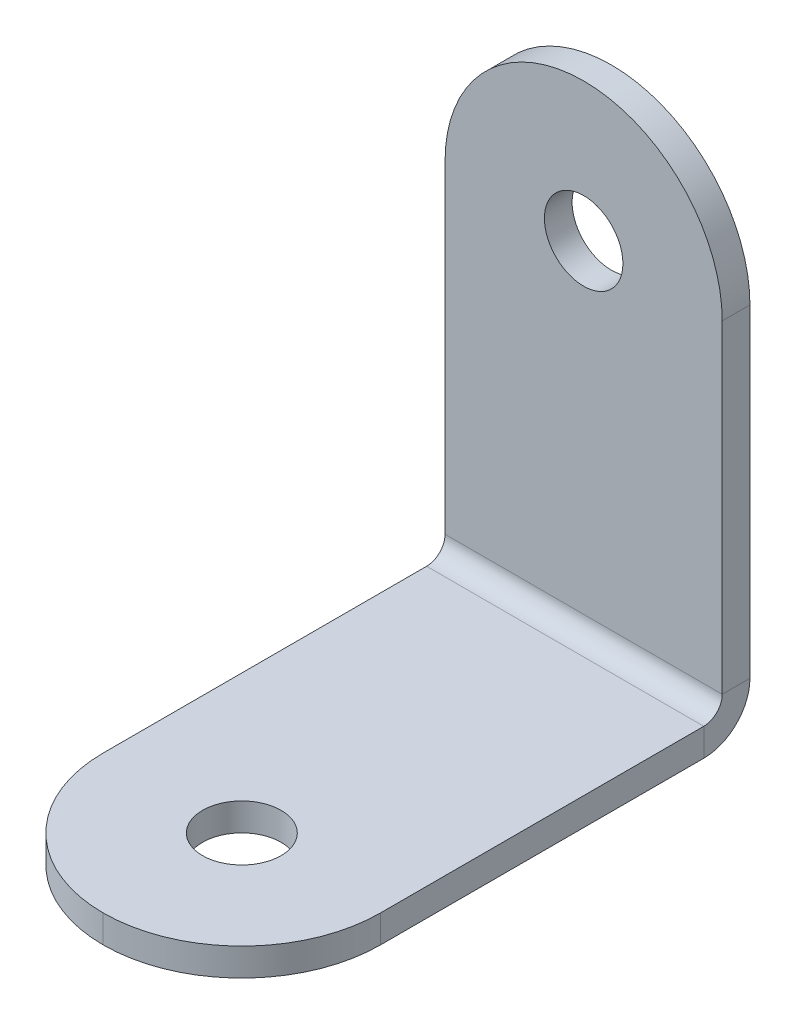
ISO-10303-21;
HEADER;
FILE_DESCRIPTION(('STEP AP214'),'2;1');
FILE_NAME('part.step','',(''),(''),'','','');
FILE_SCHEMA(('AUTOMOTIVE_DESIGN { 1 0 10303 214 1 1 1 1 }'));
ENDSEC;
DATA;
#1=APPLICATION_CONTEXT('core data for automotive mechanical design processes');
#2=APPLICATION_PROTOCOL_DEFINITION('international standard','automotive_design',2000,#1);
#3=PRODUCT_CONTEXT('',#1,'mechanical');
#4=PRODUCT('Part','Part','',(#3));
#5=PRODUCT_RELATED_PRODUCT_CATEGORY('part','',(#4));
#6=PRODUCT_DEFINITION_FORMATION('','',#4);
#7=PRODUCT_DEFINITION_CONTEXT('part definition',#1,'design');
#8=PRODUCT_DEFINITION('design','',#6,#7);
#9=PRODUCT_DEFINITION_SHAPE('','',#8);
#10=(LENGTH_UNIT() NAMED_UNIT(*) SI_UNIT(.MILLI.,.METRE.));
#11=(NAMED_UNIT(*) PLANE_ANGLE_UNIT() SI_UNIT($,.RADIAN.));
#12=(NAMED_UNIT(*) SI_UNIT($,.STERADIAN.) SOLID_ANGLE_UNIT());
#13=UNCERTAINTY_MEASURE_WITH_UNIT(LENGTH_MEASURE(1.E-05),#10,'distance_accuracy_value','');
#14=(GEOMETRIC_REPRESENTATION_CONTEXT(3) GLOBAL_UNCERTAINTY_ASSIGNED_CONTEXT((#13)) GLOBAL_UNIT_ASSIGNED_CONTEXT((#10,
#11,#12)) REPRESENTATION_CONTEXT('',''));
#15=CARTESIAN_POINT('',(0.,0.,0.));
#16=DIRECTION('',(0.,0.,1.));
#17=DIRECTION('',(1.,0.,0.));
#18=AXIS2_PLACEMENT_3D('',#15,#16,#17);
#19=CARTESIAN_POINT('',(1643.96199895819,3257.08482987434,204.999999999856));
#20=DIRECTION('',(0.,1.,0.));
#21=DIRECTION('',(0.,0.,1.));
#22=AXIS2_PLACEMENT_3D('',#19,#20,#21);
#23=CYLINDRICAL_SURFACE('',#22,30.);
#24=DIRECTION('',(0.,1.,0.));
#25=VECTOR('',#24,1.);
#26=CARTESIAN_POINT('',(1613.96199895819,3257.08482987434,204.999999999856));
#27=LINE('',#26,#25);
#28=CARTESIAN_POINT('',(1613.96199895819,3251.08482987434,204.999999999856));
#29=VERTEX_POINT('',#28);
#30=CARTESIAN_POINT('',(1613.96199895819,3257.08482987434,204.999999999856));
#31=VERTEX_POINT('',#30);
#32=EDGE_CURVE('E11',#29,#31,#27,.T.);
#33=ORIENTED_EDGE('',*,*,#32,.F.);
#34=CARTESIAN_POINT('',(1643.96199895819,3251.08482987434,204.999999999856));
#35=DIRECTION('',(0.,1.,0.));
#36=DIRECTION('',(0.,0.,1.));
#37=AXIS2_PLACEMENT_3D('',#34,#35,#36);
#38=CIRCLE('',#37,30.);
#39=CARTESIAN_POINT('',(1643.96199895819,3251.08482987434,234.999999999856));
#40=VERTEX_POINT('',#39);
#41=EDGE_CURVE('E124',#29,#40,#38,.T.);
#42=ORIENTED_EDGE('',*,*,#41,.T.);
#43=DIRECTION('',(0.,1.,0.));
#44=VECTOR('',#43,1.);
#45=CARTESIAN_POINT('',(1643.96199895819,3257.08482987434,234.999999999856));
#46=LINE('',#45,#44);
#47=CARTESIAN_POINT('',(1643.96199895819,3257.08482987434,234.999999999856));
#48=VERTEX_POINT('',#47);
#49=EDGE_CURVE('E51',#40,#48,#46,.T.);
#50=ORIENTED_EDGE('',*,*,#49,.T.);
#51=CARTESIAN_POINT('',(1643.96199895819,3257.08482987434,204.999999999856));
#52=DIRECTION('',(0.,1.,0.));
#53=DIRECTION('',(0.,0.,1.));
#54=AXIS2_PLACEMENT_3D('',#51,#52,#53);
#55=CIRCLE('',#54,30.);
#56=EDGE_CURVE('E172',#31,#48,#55,.T.);
#57=ORIENTED_EDGE('',*,*,#56,.F.);
#58=EDGE_LOOP('',(#33,#42,#50,#57));
#59=FACE_BOUND('',#58,.T.);
#60=ADVANCED_FACE('F41',(#59),#23,.T.);
#61=CARTESIAN_POINT('',(1643.96199895819,3257.08482987434,204.999999999856));
#62=DIRECTION('',(0.,1.,0.));
#63=DIRECTION('',(0.,0.,1.));
#64=AXIS2_PLACEMENT_3D('',#61,#62,#63);
#65=CYLINDRICAL_SURFACE('',#64,30.);
#66=ORIENTED_EDGE('',*,*,#49,.F.);
#67=CARTESIAN_POINT('',(1643.96199895819,3251.08482987434,204.999999999856));
#68=DIRECTION('',(0.,1.,0.));
#69=DIRECTION('',(0.,0.,1.));
#70=AXIS2_PLACEMENT_3D('',#67,#68,#69);
#71=CIRCLE('',#70,30.);
#72=CARTESIAN_POINT('',(1673.96199895819,3251.08482987434,204.999999999856));
#73=VERTEX_POINT('',#72);
#74=EDGE_CURVE('E145',#40,#73,#71,.T.);
#75=ORIENTED_EDGE('',*,*,#74,.T.);
#76=DIRECTION('',(0.,1.,0.));
#77=VECTOR('',#76,1.);
#78=CARTESIAN_POINT('',(1673.96199895819,3257.08482987434,204.999999999856));
#79=LINE('',#78,#77);
#80=CARTESIAN_POINT('',(1673.96199895819,3257.08482987434,204.999999999856));
#81=VERTEX_POINT('',#80);
#82=EDGE_CURVE('E166',#73,#81,#79,.T.);
#83=ORIENTED_EDGE('',*,*,#82,.T.);
#84=CARTESIAN_POINT('',(1643.96199895819,3257.08482987434,204.999999999856));
#85=DIRECTION('',(0.,1.,0.));
#86=DIRECTION('',(0.,0.,1.));
#87=AXIS2_PLACEMENT_3D('',#84,#85,#86);
#88=CIRCLE('',#87,30.);
#89=EDGE_CURVE('E182',#48,#81,#88,.T.);
#90=ORIENTED_EDGE('',*,*,#89,.F.);
#91=EDGE_LOOP('',(#66,#75,#83,#90));
#92=FACE_BOUND('',#91,.T.);
#93=ADVANCED_FACE('F186',(#92),#65,.T.);
#94=CARTESIAN_POINT('',(1673.96199895819,3257.08482987434,234.999999999856));
#95=DIRECTION('',(1.,0.,0.));
#96=DIRECTION('',(0.,0.,-1.));
#97=AXIS2_PLACEMENT_3D('',#94,#95,#96);
#98=PLANE('',#97);
#99=ORIENTED_EDGE('',*,*,#82,.F.);
#100=DIRECTION('',(0.,0.,1.));
#101=VECTOR('',#100,1.);
#102=CARTESIAN_POINT('',(1673.96199895819,3251.08482987434,1.38567995961089E-11));
#103=LINE('',#102,#101);
#104=CARTESIAN_POINT('',(1673.96199895819,3251.08482987434,134.999999999856));
#105=VERTEX_POINT('',#104);
#106=EDGE_CURVE('E120',#105,#73,#103,.T.);
#107=ORIENTED_EDGE('',*,*,#106,.F.);
#108=DIRECTION('',(0.,1.,0.));
#109=VECTOR('',#108,1.);
#110=CARTESIAN_POINT('',(1673.96199895819,3257.08482987434,134.999999999856));
#111=LINE('',#110,#109);
#112=CARTESIAN_POINT('',(1673.96199895819,3257.08482987434,134.999999999856));
#113=VERTEX_POINT('',#112);
#114=EDGE_CURVE('E163',#105,#113,#111,.T.);
#115=ORIENTED_EDGE('',*,*,#114,.T.);
#116=DIRECTION('',(0.,0.,-1.));
#117=VECTOR('',#116,1.);
#118=CARTESIAN_POINT('',(1673.96199895819,3257.08482987434,234.999999999856));
#119=LINE('',#118,#117);
#120=EDGE_CURVE('E187',#113,#81,#119,.F.);
#121=ORIENTED_EDGE('',*,*,#120,.T.);
#122=EDGE_LOOP('',(#99,#107,#115,#121));
#123=FACE_BOUND('',#122,.T.);
#124=ADVANCED_FACE('F210',(#123),#98,.T.);
#125=CARTESIAN_POINT('',(1673.96199895819,3261.08482987434,134.999999999856));
#126=DIRECTION('',(-1.,0.,0.));
#127=DIRECTION('',(0.,0.,1.));
#128=AXIS2_PLACEMENT_3D('',#125,#126,#127);
#129=PLANE('',#128);
#130=ORIENTED_EDGE('',*,*,#114,.F.);
#131=CARTESIAN_POINT('',(1673.96199895819,3261.08482987434,134.999999999856));
#132=DIRECTION('',(1.,0.,0.));
#133=DIRECTION('',(0.,0.,-1.));
#134=AXIS2_PLACEMENT_3D('',#131,#132,#133);
#135=CIRCLE('',#134,10.);
#136=CARTESIAN_POINT('',(1673.96199895819,3261.08482987434,124.999999999856));
#137=VERTEX_POINT('',#136);
#138=EDGE_CURVE('E116',#105,#137,#135,.T.);
#139=ORIENTED_EDGE('',*,*,#138,.T.);
#140=DIRECTION('',(0.,0.,1.));
#141=VECTOR('',#140,1.);
#142=CARTESIAN_POINT('',(1673.96199895819,3261.08482987434,130.999999999856));
#143=LINE('',#142,#141);
#144=CARTESIAN_POINT('',(1673.96199895819,3261.08482987434,130.999999999856));
#145=VERTEX_POINT('',#144);
#146=EDGE_CURVE('E160',#137,#145,#143,.T.);
#147=ORIENTED_EDGE('',*,*,#146,.T.);
#148=CARTESIAN_POINT('',(1673.96199895819,3261.08482987434,134.999999999856));
#149=DIRECTION('',(1.,0.,0.));
#150=DIRECTION('',(0.,0.,-1.));
#151=AXIS2_PLACEMENT_3D('',#148,#149,#150);
#152=CIRCLE('',#151,4.);
#153=EDGE_CURVE('E105',#113,#145,#152,.T.);
#154=ORIENTED_EDGE('',*,*,#153,.F.);
#155=EDGE_LOOP('',(#130,#139,#147,#154));
#156=FACE_BOUND('',#155,.T.);
#157=ADVANCED_FACE('F206',(#156),#129,.F.);
#158=CARTESIAN_POINT('',(1673.96199895819,3331.08482987434,130.999999999856));
#159=DIRECTION('',(1.,0.,0.));
#160=DIRECTION('',(0.,1.,0.));
#161=AXIS2_PLACEMENT_3D('',#158,#159,#160);
#162=PLANE('',#161);
#163=ORIENTED_EDGE('',*,*,#146,.F.);
#164=DIRECTION('',(0.,1.,0.));
#165=VECTOR('',#164,1.);
#166=CARTESIAN_POINT('',(1673.96199895819,3331.08482987434,124.999999999856));
#167=LINE('',#166,#165);
#168=CARTESIAN_POINT('',(1673.96199895819,3331.08482987434,124.999999999856));
#169=VERTEX_POINT('',#168);
#170=EDGE_CURVE('E141',#137,#169,#167,.T.);
#171=ORIENTED_EDGE('',*,*,#170,.T.);
#172=DIRECTION('',(0.,0.,1.));
#173=VECTOR('',#172,1.);
#174=CARTESIAN_POINT('',(1673.96199895819,3331.08482987434,130.999999999856));
#175=LINE('',#174,#173);
#176=CARTESIAN_POINT('',(1673.96199895819,3331.08482987434,130.999999999856));
#177=VERTEX_POINT('',#176);
#178=EDGE_CURVE('E157',#169,#177,#175,.T.);
#179=ORIENTED_EDGE('',*,*,#178,.T.);
#180=DIRECTION('',(0.,1.,0.));
#181=VECTOR('',#180,1.);
#182=CARTESIAN_POINT('',(1673.96199895819,3331.08482987434,130.999999999856));
#183=LINE('',#182,#181);
#184=EDGE_CURVE('E219',#145,#177,#183,.T.);
#185=ORIENTED_EDGE('',*,*,#184,.F.);
#186=EDGE_LOOP('',(#163,#171,#179,#185));
#187=FACE_BOUND('',#186,.T.);
#188=ADVANCED_FACE('F285',(#187),#162,.T.);
#189=CARTESIAN_POINT('',(1643.96199895819,3331.08482987434,130.999999999856));
#190=DIRECTION('',(0.,0.,1.));
#191=DIRECTION('',(1.,0.,0.));
#192=AXIS2_PLACEMENT_3D('',#189,#190,#191);
#193=CYLINDRICAL_SURFACE('',#192,30.);
#194=ORIENTED_EDGE('',*,*,#178,.F.);
#195=CARTESIAN_POINT('',(1643.96199895819,3331.08482987434,124.999999999856));
#196=DIRECTION('',(0.,0.,1.));
#197=DIRECTION('',(1.,0.,0.));
#198=AXIS2_PLACEMENT_3D('',#195,#196,#197);
#199=CIRCLE('',#198,30.);
#200=CARTESIAN_POINT('',(1613.96199895819,3331.08482987434,124.999999999856));
#201=VERTEX_POINT('',#200);
#202=EDGE_CURVE('E137',#169,#201,#199,.T.);
#203=ORIENTED_EDGE('',*,*,#202,.T.);
#204=DIRECTION('',(0.,0.,1.));
#205=VECTOR('',#204,1.);
#206=CARTESIAN_POINT('',(1613.96199895819,3331.08482987434,130.999999999856));
#207=LINE('',#206,#205);
#208=CARTESIAN_POINT('',(1613.96199895819,3331.08482987434,130.999999999856));
#209=VERTEX_POINT('',#208);
#210=EDGE_CURVE('E154',#201,#209,#207,.T.);
#211=ORIENTED_EDGE('',*,*,#210,.T.);
#212=CARTESIAN_POINT('',(1643.96199895819,3331.08482987434,130.999999999856));
#213=DIRECTION('',(0.,0.,1.));
#214=DIRECTION('',(1.,0.,0.));
#215=AXIS2_PLACEMENT_3D('',#212,#213,#214);
#216=CIRCLE('',#215,30.);
#217=EDGE_CURVE('E222',#177,#209,#216,.T.);
#218=ORIENTED_EDGE('',*,*,#217,.F.);
#219=EDGE_LOOP('',(#194,#203,#211,#218));
#220=FACE_BOUND('',#219,.T.);
#221=ADVANCED_FACE('F281',(#220),#193,.T.);
#222=CARTESIAN_POINT('',(1613.96199895819,3331.08482987434,130.999999999856));
#223=DIRECTION('',(-1.,0.,0.));
#224=DIRECTION('',(0.,-1.,0.));
#225=AXIS2_PLACEMENT_3D('',#222,#223,#224);
#226=PLANE('',#225);
#227=ORIENTED_EDGE('',*,*,#210,.F.);
#228=DIRECTION('',(0.,1.,0.));
#229=VECTOR('',#228,1.);
#230=CARTESIAN_POINT('',(1613.96199895819,3331.08482987434,124.999999999856));
#231=LINE('',#230,#229);
#232=CARTESIAN_POINT('',(1613.96199895819,3261.08482987434,124.999999999856));
#233=VERTEX_POINT('',#232);
#234=EDGE_CURVE('E133',#201,#233,#231,.F.);
#235=ORIENTED_EDGE('',*,*,#234,.T.);
#236=DIRECTION('',(0.,0.,1.));
#237=VECTOR('',#236,1.);
#238=CARTESIAN_POINT('',(1613.96199895819,3261.08482987434,130.999999999856));
#239=LINE('',#238,#237);
#240=CARTESIAN_POINT('',(1613.96199895819,3261.08482987434,130.999999999856));
#241=VERTEX_POINT('',#240);
#242=EDGE_CURVE('E104',#233,#241,#239,.T.);
#243=ORIENTED_EDGE('',*,*,#242,.T.);
#244=DIRECTION('',(0.,-1.,0.));
#245=VECTOR('',#244,1.);
#246=CARTESIAN_POINT('',(1613.96199895819,3331.08482987434,130.999999999856));
#247=LINE('',#246,#245);
#248=EDGE_CURVE('E220',#209,#241,#247,.T.);
#249=ORIENTED_EDGE('',*,*,#248,.F.);
#250=EDGE_LOOP('',(#227,#235,#243,#249));
#251=FACE_BOUND('',#250,.T.);
#252=ADVANCED_FACE('F263',(#251),#226,.T.);
#253=CARTESIAN_POINT('',(1613.96199895819,3261.08482987434,134.999999999856));
#254=DIRECTION('',(-1.,0.,0.));
#255=DIRECTION('',(0.,0.,1.));
#256=AXIS2_PLACEMENT_3D('',#253,#254,#255);
#257=PLANE('',#256);
#258=ORIENTED_EDGE('',*,*,#242,.F.);
#259=CARTESIAN_POINT('',(1613.96199895819,3261.08482987434,134.999999999856));
#260=DIRECTION('',(1.,0.,0.));
#261=DIRECTION('',(0.,0.,-1.));
#262=AXIS2_PLACEMENT_3D('',#259,#260,#261);
#263=CIRCLE('',#262,10.);
#264=CARTESIAN_POINT('',(1613.96199895819,3251.08482987434,134.999999999856));
#265=VERTEX_POINT('',#264);
#266=EDGE_CURVE('E113',#233,#265,#263,.F.);
#267=ORIENTED_EDGE('',*,*,#266,.T.);
#268=DIRECTION('',(0.,1.,0.));
#269=VECTOR('',#268,1.);
#270=CARTESIAN_POINT('',(1613.96199895819,3257.08482987434,134.999999999856));
#271=LINE('',#270,#269);
#272=CARTESIAN_POINT('',(1613.96199895819,3257.08482987434,134.999999999856));
#273=VERTEX_POINT('',#272);
#274=EDGE_CURVE('E45',#265,#273,#271,.T.);
#275=ORIENTED_EDGE('',*,*,#274,.T.);
#276=CARTESIAN_POINT('',(1613.96199895819,3261.08482987434,134.999999999856));
#277=DIRECTION('',(1.,0.,0.));
#278=DIRECTION('',(0.,0.,-1.));
#279=AXIS2_PLACEMENT_3D('',#276,#277,#278);
#280=CIRCLE('',#279,4.);
#281=EDGE_CURVE('E196',#241,#273,#280,.F.);
#282=ORIENTED_EDGE('',*,*,#281,.F.);
#283=EDGE_LOOP('',(#258,#267,#275,#282));
#284=FACE_BOUND('',#283,.T.);
#285=ADVANCED_FACE('F126',(#284),#257,.T.);
#286=CARTESIAN_POINT('',(1643.96199895819,3331.08482987434,130.999999999856));
#287=DIRECTION('',(0.,0.,1.));
#288=DIRECTION('',(1.,0.,0.));
#289=AXIS2_PLACEMENT_3D('',#286,#287,#288);
#290=CYLINDRICAL_SURFACE('',#289,8.50000000000004);
#291=CARTESIAN_POINT('',(1643.96199895819,3331.08482987434,130.999999999856));
#292=DIRECTION('',(0.,0.,1.));
#293=DIRECTION('',(1.,0.,0.));
#294=AXIS2_PLACEMENT_3D('',#291,#292,#293);
#295=CIRCLE('',#294,8.50000000000004);
#296=CARTESIAN_POINT('',(1652.46199895819,3331.08482987434,130.999999999856));
#297=VERTEX_POINT('',#296);
#298=EDGE_CURVE('E129',#297,#297,#295,.T.);
#299=ORIENTED_EDGE('',*,*,#298,.T.);
#300=EDGE_LOOP('',(#299));
#301=FACE_BOUND('',#300,.T.);
#302=CARTESIAN_POINT('',(1643.96199895819,3331.08482987434,124.999999999856));
#303=DIRECTION('',(0.,0.,1.));
#304=DIRECTION('',(1.,0.,0.));
#305=AXIS2_PLACEMENT_3D('',#302,#303,#304);
#306=CIRCLE('',#305,8.50000000000004);
#307=CARTESIAN_POINT('',(1652.46199895819,3331.08482987434,124.999999999856));
#308=VERTEX_POINT('',#307);
#309=EDGE_CURVE('E136',#308,#308,#306,.T.);
#310=ORIENTED_EDGE('',*,*,#309,.F.);
#311=EDGE_LOOP('',(#310));
#312=FACE_BOUND('',#311,.T.);
#313=ADVANCED_FACE('F43',(#301,#312),#290,.F.);
#314=CARTESIAN_POINT('',(1643.96199895819,3257.08482987434,204.999999999856));
#315=DIRECTION('',(0.,1.,0.));
#316=DIRECTION('',(0.,0.,1.));
#317=AXIS2_PLACEMENT_3D('',#314,#315,#316);
#318=CYLINDRICAL_SURFACE('',#317,8.5);
#319=CARTESIAN_POINT('',(1643.96199895819,3257.08482987434,204.999999999856));
#320=DIRECTION('',(0.,1.,0.));
#321=DIRECTION('',(0.,0.,1.));
#322=AXIS2_PLACEMENT_3D('',#319,#320,#321);
#323=CIRCLE('',#322,8.5);
#324=CARTESIAN_POINT('',(1643.96199895819,3257.08482987434,213.499999999856));
#325=VERTEX_POINT('',#324);
#326=EDGE_CURVE('E184',#325,#325,#323,.T.);
#327=ORIENTED_EDGE('',*,*,#326,.T.);
#328=EDGE_LOOP('',(#327));
#329=FACE_BOUND('',#328,.T.);
#330=CARTESIAN_POINT('',(1643.96199895819,3251.08482987434,204.999999999856));
#331=DIRECTION('',(0.,1.,0.));
#332=DIRECTION('',(0.,0.,1.));
#333=AXIS2_PLACEMENT_3D('',#330,#331,#332);
#334=CIRCLE('',#333,8.5);
#335=CARTESIAN_POINT('',(1643.96199895819,3251.08482987434,213.499999999856));
#336=VERTEX_POINT('',#335);
#337=EDGE_CURVE('E140',#336,#336,#334,.T.);
#338=ORIENTED_EDGE('',*,*,#337,.F.);
#339=EDGE_LOOP('',(#338));
#340=FACE_BOUND('',#339,.T.);
#341=ADVANCED_FACE('F231',(#329,#340),#318,.F.);
#342=CARTESIAN_POINT('',(1613.96199895819,3257.08482987434,130.999999999856));
#343=DIRECTION('',(-1.,0.,0.));
#344=DIRECTION('',(0.,0.,1.));
#345=AXIS2_PLACEMENT_3D('',#342,#343,#344);
#346=PLANE('',#345);
#347=DIRECTION('',(0.,0.,1.));
#348=VECTOR('',#347,1.);
#349=CARTESIAN_POINT('',(1613.96199895819,3251.08482987434,1.38567995961089E-11));
#350=LINE('',#349,#348);
#351=EDGE_CURVE('E97',#29,#265,#350,.F.);
#352=ORIENTED_EDGE('',*,*,#351,.F.);
#353=ORIENTED_EDGE('',*,*,#32,.T.);
#354=DIRECTION('',(0.,0.,1.));
#355=VECTOR('',#354,1.);
#356=CARTESIAN_POINT('',(1613.96199895819,3257.08482987434,130.999999999856));
#357=LINE('',#356,#355);
#358=EDGE_CURVE('E98',#31,#273,#357,.F.);
#359=ORIENTED_EDGE('',*,*,#358,.T.);
#360=ORIENTED_EDGE('',*,*,#274,.F.);
#361=EDGE_LOOP('',(#352,#353,#359,#360));
#362=FACE_BOUND('',#361,.T.);
#363=ADVANCED_FACE('F95',(#362),#346,.T.);
#364=CARTESIAN_POINT('',(1673.96199895819,3261.08482987434,134.999999999856));
#365=DIRECTION('',(1.,0.,0.));
#366=DIRECTION('',(0.,-1.,0.));
#367=AXIS2_PLACEMENT_3D('',#364,#365,#366);
#368=CYLINDRICAL_SURFACE('',#367,4.);
#369=DIRECTION('',(1.,0.,0.));
#370=VECTOR('',#369,1.);
#371=CARTESIAN_POINT('',(1673.96199895819,3261.08482987434,130.999999999856));
#372=LINE('',#371,#370);
#373=EDGE_CURVE('E215',#145,#241,#372,.F.);
#374=ORIENTED_EDGE('',*,*,#373,.T.);
#375=ORIENTED_EDGE('',*,*,#281,.T.);
#376=DIRECTION('',(1.,0.,0.));
#377=VECTOR('',#376,1.);
#378=CARTESIAN_POINT('',(1613.96199895819,3257.08482987434,134.999999999856));
#379=LINE('',#378,#377);
#380=EDGE_CURVE('E189',#273,#113,#379,.T.);
#381=ORIENTED_EDGE('',*,*,#380,.T.);
#382=ORIENTED_EDGE('',*,*,#153,.T.);
#383=EDGE_LOOP('',(#374,#375,#381,#382));
#384=FACE_BOUND('',#383,.T.);
#385=ADVANCED_FACE('F213',(#384),#368,.F.);
#386=CARTESIAN_POINT('',(0.,3257.08482987434,1.38824201274464E-11));
#387=DIRECTION('',(0.,1.,0.));
#388=DIRECTION('',(0.,0.,1.));
#389=AXIS2_PLACEMENT_3D('',#386,#387,#388);
#390=PLANE('',#389);
#391=ORIENTED_EDGE('',*,*,#326,.F.);
#392=EDGE_LOOP('',(#391));
#393=FACE_BOUND('',#392,.T.);
#394=ORIENTED_EDGE('',*,*,#56,.T.);
#395=ORIENTED_EDGE('',*,*,#89,.T.);
#396=ORIENTED_EDGE('',*,*,#120,.F.);
#397=ORIENTED_EDGE('',*,*,#380,.F.);
#398=ORIENTED_EDGE('',*,*,#358,.F.);
#399=EDGE_LOOP('',(#394,#395,#396,#397,#398));
#400=FACE_BOUND('',#399,.T.);
#401=ADVANCED_FACE('F180',(#393,#400),#390,.T.);
#402=CARTESIAN_POINT('',(1643.96199895819,3331.08482987434,130.999999999856));
#403=DIRECTION('',(0.,0.,1.));
#404=DIRECTION('',(1.,0.,0.));
#405=AXIS2_PLACEMENT_3D('',#402,#403,#404);
#406=PLANE('',#405);
#407=ORIENTED_EDGE('',*,*,#298,.F.);
#408=EDGE_LOOP('',(#407));
#409=FACE_BOUND('',#408,.T.);
#410=ORIENTED_EDGE('',*,*,#248,.T.);
#411=ORIENTED_EDGE('',*,*,#373,.F.);
#412=ORIENTED_EDGE('',*,*,#184,.T.);
#413=ORIENTED_EDGE('',*,*,#217,.T.);
#414=EDGE_LOOP('',(#410,#411,#412,#413));
#415=FACE_BOUND('',#414,.T.);
#416=ADVANCED_FACE('F235',(#409,#415),#406,.T.);
#417=CARTESIAN_POINT('',(1673.96199895819,3261.08482987434,134.999999999856));
#418=DIRECTION('',(1.,0.,0.));
#419=DIRECTION('',(0.,-1.,0.));
#420=AXIS2_PLACEMENT_3D('',#417,#418,#419);
#421=CYLINDRICAL_SURFACE('',#420,10.);
#422=DIRECTION('',(1.,0.,0.));
#423=VECTOR('',#422,1.);
#424=CARTESIAN_POINT('',(1673.96199895819,3261.08482987434,124.999999999856));
#425=LINE('',#424,#423);
#426=EDGE_CURVE('E135',#137,#233,#425,.F.);
#427=ORIENTED_EDGE('',*,*,#426,.F.);
#428=ORIENTED_EDGE('',*,*,#138,.F.);
#429=DIRECTION('',(1.,0.,0.));
#430=VECTOR('',#429,1.);
#431=CARTESIAN_POINT('',(1673.96199895819,3251.08482987434,134.999999999856));
#432=LINE('',#431,#430);
#433=EDGE_CURVE('E110',#265,#105,#432,.T.);
#434=ORIENTED_EDGE('',*,*,#433,.F.);
#435=ORIENTED_EDGE('',*,*,#266,.F.);
#436=EDGE_LOOP('',(#427,#428,#434,#435));
#437=FACE_BOUND('',#436,.T.);
#438=ADVANCED_FACE('F112',(#437),#421,.T.);
#439=CARTESIAN_POINT('',(0.,3251.08482987434,1.38567995961089E-11));
#440=DIRECTION('',(0.,1.,0.));
#441=DIRECTION('',(0.,0.,1.));
#442=AXIS2_PLACEMENT_3D('',#439,#440,#441);
#443=PLANE('',#442);
#444=ORIENTED_EDGE('',*,*,#337,.T.);
#445=EDGE_LOOP('',(#444));
#446=FACE_BOUND('',#445,.T.);
#447=ORIENTED_EDGE('',*,*,#41,.F.);
#448=ORIENTED_EDGE('',*,*,#351,.T.);
#449=ORIENTED_EDGE('',*,*,#433,.T.);
#450=ORIENTED_EDGE('',*,*,#106,.T.);
#451=ORIENTED_EDGE('',*,*,#74,.F.);
#452=EDGE_LOOP('',(#447,#448,#449,#450,#451));
#453=FACE_BOUND('',#452,.T.);
#454=ADVANCED_FACE('F122',(#446,#453),#443,.F.);
#455=CARTESIAN_POINT('',(1643.96199895819,3331.08482987434,124.999999999856));
#456=DIRECTION('',(0.,0.,1.));
#457=DIRECTION('',(1.,0.,0.));
#458=AXIS2_PLACEMENT_3D('',#455,#456,#457);
#459=PLANE('',#458);
#460=ORIENTED_EDGE('',*,*,#309,.T.);
#461=EDGE_LOOP('',(#460));
#462=FACE_BOUND('',#461,.T.);
#463=ORIENTED_EDGE('',*,*,#234,.F.);
#464=ORIENTED_EDGE('',*,*,#202,.F.);
#465=ORIENTED_EDGE('',*,*,#170,.F.);
#466=ORIENTED_EDGE('',*,*,#426,.T.);
#467=EDGE_LOOP('',(#463,#464,#465,#466));
#468=FACE_BOUND('',#467,.T.);
#469=ADVANCED_FACE('F202',(#462,#468),#459,.F.);
#470=CLOSED_SHELL('',(#60,#93,#124,#157,#188,#221,#252,#285,#313,#341,#363,#385,#401,#416,#438,
#454,#469));
#471=MANIFOLD_SOLID_BREP('B2',#470);
#472=ADVANCED_BREP_SHAPE_REPRESENTATION('',(#18,#471),#14);
#473=SHAPE_DEFINITION_REPRESENTATION(#9,#472);
ENDSEC;
END-ISO-10303-21;
